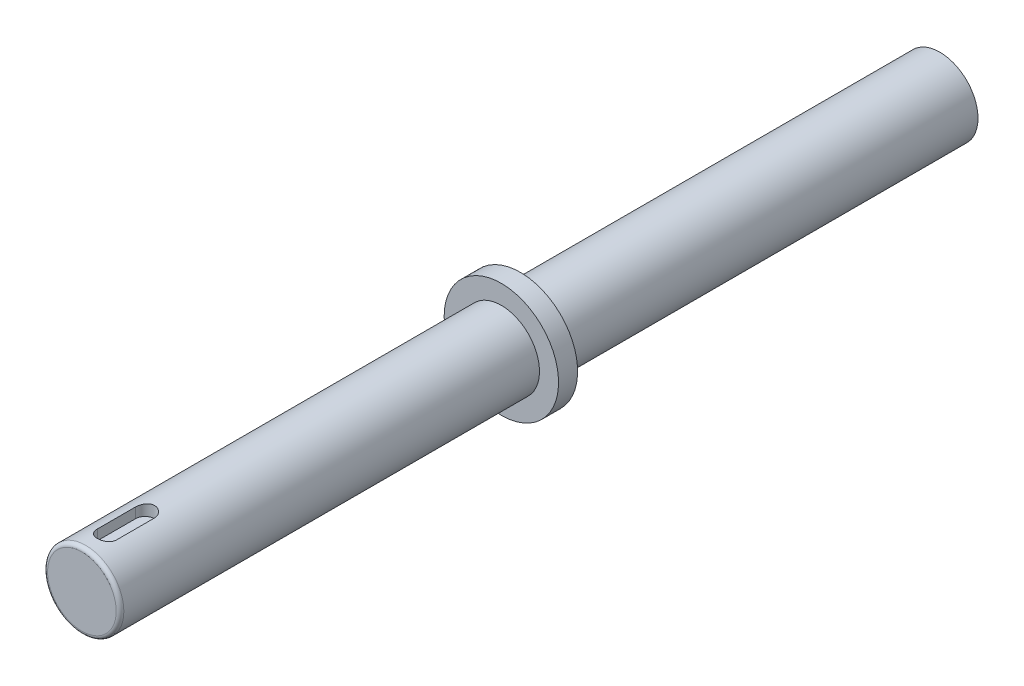
ISO-10303-21;
HEADER;
FILE_DESCRIPTION(('STEP AP214'),'2;1');
FILE_NAME('part.step','',(''),(''),'','','');
FILE_SCHEMA(('AUTOMOTIVE_DESIGN { 1 0 10303 214 1 1 1 1 }'));
ENDSEC;
DATA;
#1=APPLICATION_CONTEXT('core data for automotive mechanical design processes');
#2=APPLICATION_PROTOCOL_DEFINITION('international standard','automotive_design',2000,#1);
#3=PRODUCT_CONTEXT('',#1,'mechanical');
#4=PRODUCT('Part','Part','',(#3));
#5=PRODUCT_RELATED_PRODUCT_CATEGORY('part','',(#4));
#6=PRODUCT_DEFINITION_FORMATION('','',#4);
#7=PRODUCT_DEFINITION_CONTEXT('part definition',#1,'design');
#8=PRODUCT_DEFINITION('design','',#6,#7);
#9=PRODUCT_DEFINITION_SHAPE('','',#8);
#10=(LENGTH_UNIT() NAMED_UNIT(*) SI_UNIT(.MILLI.,.METRE.));
#11=(NAMED_UNIT(*) PLANE_ANGLE_UNIT() SI_UNIT($,.RADIAN.));
#12=(NAMED_UNIT(*) SI_UNIT($,.STERADIAN.) SOLID_ANGLE_UNIT());
#13=UNCERTAINTY_MEASURE_WITH_UNIT(LENGTH_MEASURE(1.E-05),#10,'distance_accuracy_value','');
#14=(GEOMETRIC_REPRESENTATION_CONTEXT(3) GLOBAL_UNCERTAINTY_ASSIGNED_CONTEXT((#13)) GLOBAL_UNIT_ASSIGNED_CONTEXT((#10,
#11,#12)) REPRESENTATION_CONTEXT('',''));
#15=CARTESIAN_POINT('',(0.,0.,0.));
#16=DIRECTION('',(0.,0.,1.));
#17=DIRECTION('',(1.,0.,0.));
#18=AXIS2_PLACEMENT_3D('',#15,#16,#17);
#19=CARTESIAN_POINT('',(0.,0.,225.));
#20=DIRECTION('',(0.,0.,-1.));
#21=DIRECTION('',(-1.,0.,0.));
#22=AXIS2_PLACEMENT_3D('',#19,#20,#21);
#23=CYLINDRICAL_SURFACE('',#22,10.);
#24=CARTESIAN_POINT('',(0.,0.,224.));
#25=DIRECTION('',(0.,0.,1.));
#26=DIRECTION('',(1.,0.,0.));
#27=AXIS2_PLACEMENT_3D('',#24,#25,#26);
#28=CIRCLE('',#27,10.);
#29=CARTESIAN_POINT('',(10.,0.,224.));
#30=VERTEX_POINT('',#29);
#31=EDGE_CURVE('E11',#30,#30,#28,.F.);
#32=ORIENTED_EDGE('',*,*,#31,.T.);
#33=EDGE_LOOP('',(#32));
#34=FACE_BOUND('',#33,.T.);
#35=CARTESIAN_POINT('',(0.,0.,115.));
#36=DIRECTION('',(0.,0.,-1.));
#37=DIRECTION('',(-1.,0.,0.));
#38=AXIS2_PLACEMENT_3D('',#35,#36,#37);
#39=CIRCLE('',#38,10.);
#40=CARTESIAN_POINT('',(-10.,0.,115.));
#41=VERTEX_POINT('',#40);
#42=EDGE_CURVE('E109',#41,#41,#39,.T.);
#43=ORIENTED_EDGE('',*,*,#42,.F.);
#44=EDGE_LOOP('',(#43));
#45=FACE_BOUND('',#44,.T.);
#46=CARTESIAN_POINT('',(2.5,9.68245836551854,208.431386242727));
#47=CARTESIAN_POINT('',(2.5000080093561,9.68245064107173,208.362248457578));
#48=CARTESIAN_POINT('',(2.49713210094488,9.68319871214971,208.293115423162));
#49=CARTESIAN_POINT('',(2.4856746565857,9.68614915569249,208.155366318143));
#50=CARTESIAN_POINT('',(2.477094080727,9.68835128344072,208.086750162514));
#51=CARTESIAN_POINT('',(2.4543119967113,9.6941468560817,207.950653244628));
#52=CARTESIAN_POINT('',(2.44012162652341,9.69773754375151,207.883170507132));
#53=CARTESIAN_POINT('',(2.40625174004097,9.70619672728078,207.749697432417));
#54=CARTESIAN_POINT('',(2.3865721482595,9.71106524071264,207.683707115735));
#55=CARTESIAN_POINT('',(2.31951549528411,9.7273836995917,207.488676161632));
#56=CARTESIAN_POINT('',(2.26409745840537,9.74055281563065,207.362438792887));
#57=CARTESIAN_POINT('',(2.13353299875772,9.7699788620753,207.121080368106));
#58=CARTESIAN_POINT('',(2.05838128580475,9.78623662015741,207.005962304257));
#59=CARTESIAN_POINT('',(1.88871268115755,9.82040642202058,206.787534051818));
#60=CARTESIAN_POINT('',(1.79384357452294,9.83834473874501,206.684501041515));
#61=CARTESIAN_POINT('',(1.58818904866333,9.87362764688863,206.495629004297));
#62=CARTESIAN_POINT('',(1.47740109012643,9.89097214303631,206.409792725776));
#63=CARTESIAN_POINT('',(1.24114235858889,9.92340454696925,206.256609289538));
#64=CARTESIAN_POINT('',(1.11548838031036,9.93845761433587,206.189536650254));
#65=CARTESIAN_POINT('',(0.854256447638938,9.96430865897157,206.077574259778));
#66=CARTESIAN_POINT('',(0.71868045238697,9.97510747358589,206.032680142844));
#67=CARTESIAN_POINT('',(0.444360278975154,9.99104749942438,205.967238799125));
#68=CARTESIAN_POINT('',(0.305735807058597,9.99629882234408,205.946217071936));
#69=CARTESIAN_POINT('',(0.0268319371530321,10.0009359539588,205.927627803605));
#70=CARTESIAN_POINT('',(-0.113447250615645,10.0003224998861,205.930057314525));
#71=CARTESIAN_POINT('',(-0.388381231898406,9.99338093409452,205.957961154602));
#72=CARTESIAN_POINT('',(-0.523091754207081,9.98717996692084,205.982922784939));
#73=CARTESIAN_POINT('',(-0.786346777853399,9.96990826592558,206.054357939971));
#74=CARTESIAN_POINT('',(-0.914891006098323,9.95883731664276,206.100832416457));
#75=CARTESIAN_POINT('',(-1.16351821502263,9.93287494404107,206.214389444598));
#76=CARTESIAN_POINT('',(-1.28351407399523,9.91794984568669,206.281654728361));
#77=CARTESIAN_POINT('',(-1.51069157808541,9.88589863855019,206.434744067259));
#78=CARTESIAN_POINT('',(-1.61787128890854,9.8687721983349,206.520570918346));
#79=CARTESIAN_POINT('',(-1.81942347426832,9.83363915056657,206.711083522945));
#80=CARTESIAN_POINT('',(-1.9133727576345,9.81562126192392,206.81621533408));
#81=CARTESIAN_POINT('',(-2.08242393796641,9.78115420711838,207.040960910043));
#82=CARTESIAN_POINT('',(-2.15752067561301,9.76470547114267,207.160578625937));
#83=CARTESIAN_POINT('',(-2.28701177321454,9.73519533958994,207.411750237286));
#84=CARTESIAN_POINT('',(-2.34129254471755,9.72215264997332,207.543364904962));
#85=CARTESIAN_POINT('',(-2.42675587962519,9.70117647043109,207.814178563779));
#86=CARTESIAN_POINT('',(-2.45797297303244,9.693235344986,207.953365880624));
#87=CARTESIAN_POINT('',(-2.48476158787698,9.6863822666606,208.150029694619));
#88=CARTESIAN_POINT('',(-2.49047697741524,9.68491307675692,208.206185500743));
#89=CARTESIAN_POINT('',(-2.49809189424097,9.6829515607634,208.318680717475));
#90=CARTESIAN_POINT('',(-2.49999759523778,9.68245765421489,208.375019682592));
#91=CARTESIAN_POINT('',(-2.5,9.68245836551854,208.431386242727));
#92=B_SPLINE_CURVE_WITH_KNOTS('',3,(#46,#47,#48,#49,#50,#51,#52,#53,#54,#55,#56,#57,#58,#59,#60,
#61,#62,#63,#64,#65,#66,#67,#68,#69,#70,#71,#72,#73,#74,#75,#76,#77,#78,#79,#80,#81,#82,#83,#84,
#85,#86,#87,#88,#89,#90,#91),.UNSPECIFIED.,.F.,.F.,(4,2,2,2,2,2,2,2,2,2,2,2,2,2,2,2,2,2,2,2,2,2,
4),(0.,0.207341325849406,0.414647765211617,0.621544658575852,0.828444397294139,1.24183269482213,
1.65533192641021,2.07697423316326,2.49868387344133,2.92627416704922,3.35378025790395,
3.77263152747646,4.19143014600931,4.60093312657523,5.0104542264893,5.42368222585276,
5.83697251370156,6.2614052279569,6.68595396911753,7.11278749362004,7.53898067809299,
7.70826570767019,7.87727618290648),.UNSPECIFIED.);
#93=CARTESIAN_POINT('',(2.5,9.68245836551854,208.431386242727));
#94=VERTEX_POINT('',#93);
#95=CARTESIAN_POINT('',(-2.5,9.68245836551854,208.431386242727));
#96=VERTEX_POINT('',#95);
#97=EDGE_CURVE('E53',#94,#96,#92,.T.);
#98=ORIENTED_EDGE('',*,*,#97,.F.);
#99=DIRECTION('',(0.,0.,-1.));
#100=VECTOR('',#99,1.);
#101=CARTESIAN_POINT('',(2.5,9.68245836551854,225.));
#102=LINE('',#101,#100);
#103=CARTESIAN_POINT('',(2.5,9.68245836551854,218.431386242727));
#104=VERTEX_POINT('',#103);
#105=EDGE_CURVE('E114',#104,#94,#102,.T.);
#106=ORIENTED_EDGE('',*,*,#105,.F.);
#107=CARTESIAN_POINT('',(-2.5,9.68245836551854,218.431386242727));
#108=CARTESIAN_POINT('',(-2.5000080093561,9.68245064107173,218.500524027877));
#109=CARTESIAN_POINT('',(-2.49713210094488,9.68319871214971,218.569657062292));
#110=CARTESIAN_POINT('',(-2.4856746565857,9.68614915569249,218.707406167312));
#111=CARTESIAN_POINT('',(-2.477094080727,9.68835128344072,218.776022322941));
#112=CARTESIAN_POINT('',(-2.4543119967113,9.6941468560817,218.912119240827));
#113=CARTESIAN_POINT('',(-2.44012162652341,9.69773754375151,218.979601978323));
#114=CARTESIAN_POINT('',(-2.40625174004097,9.70619672728078,219.113075053038));
#115=CARTESIAN_POINT('',(-2.3865721482595,9.71106524071264,219.179065369719));
#116=CARTESIAN_POINT('',(-2.31951549528412,9.7273836995917,219.374096323823));
#117=CARTESIAN_POINT('',(-2.26409745840539,9.74055281563065,219.500333692568));
#118=CARTESIAN_POINT('',(-2.13353299875774,9.76997886207529,219.741692117349));
#119=CARTESIAN_POINT('',(-2.05838128580476,9.7862366201574,219.856810181197));
#120=CARTESIAN_POINT('',(-1.88871268115755,9.82040642202058,220.075238433637));
#121=CARTESIAN_POINT('',(-1.79384357452293,9.83834473874501,220.178271443939));
#122=CARTESIAN_POINT('',(-1.58818904866332,9.87362764688863,220.367143481158));
#123=CARTESIAN_POINT('',(-1.47740109012642,9.89097214303631,220.452979759679));
#124=CARTESIAN_POINT('',(-1.24114235858888,9.92340454696925,220.606163195917));
#125=CARTESIAN_POINT('',(-1.11548838031036,9.93845761433587,220.6732358352));
#126=CARTESIAN_POINT('',(-0.854256447638939,9.96430865897157,220.785198225677));
#127=CARTESIAN_POINT('',(-0.71868045238697,9.97510747358589,220.830092342611));
#128=CARTESIAN_POINT('',(-0.444360278975154,9.99104749942438,220.89553368633));
#129=CARTESIAN_POINT('',(-0.305735807058597,9.99629882234408,220.916555413519));
#130=CARTESIAN_POINT('',(-0.0268319371530321,10.0009359539588,220.93514468185));
#131=CARTESIAN_POINT('',(0.113447250615645,10.0003224998861,220.93271517093));
#132=CARTESIAN_POINT('',(0.388381231898406,9.99338093409452,220.904811330853));
#133=CARTESIAN_POINT('',(0.523091754207081,9.98717996692084,220.879849700515));
#134=CARTESIAN_POINT('',(0.786346777853399,9.96990826592558,220.808414545484));
#135=CARTESIAN_POINT('',(0.914891006098323,9.95883731664276,220.761940068998));
#136=CARTESIAN_POINT('',(1.16351821502263,9.93287494404107,220.648383040857));
#137=CARTESIAN_POINT('',(1.28351407399523,9.91794984568669,220.581117757093));
#138=CARTESIAN_POINT('',(1.51069157808541,9.88589863855019,220.428028418196));
#139=CARTESIAN_POINT('',(1.61787128890854,9.86877219833489,220.342201567108));
#140=CARTESIAN_POINT('',(1.81942347426831,9.83363915056657,220.15168896251));
#141=CARTESIAN_POINT('',(1.91337275763449,9.81562126192392,220.046557151374));
#142=CARTESIAN_POINT('',(2.0824239379664,9.78115420711838,219.821811575412));
#143=CARTESIAN_POINT('',(2.15752067561301,9.76470547114267,219.702193859518));
#144=CARTESIAN_POINT('',(2.28701177321454,9.73519533958994,219.451022248169));
#145=CARTESIAN_POINT('',(2.34129254471755,9.72215264997332,219.319407580493));
#146=CARTESIAN_POINT('',(2.42675587962519,9.70117647043109,219.048593921676));
#147=CARTESIAN_POINT('',(2.45797297303244,9.693235344986,218.90940660483));
#148=CARTESIAN_POINT('',(2.48476158787698,9.6863822666606,218.712742790836));
#149=CARTESIAN_POINT('',(2.49047697741524,9.68491307675692,218.656586984711));
#150=CARTESIAN_POINT('',(2.49809189424097,9.6829515607634,218.54409176798));
#151=CARTESIAN_POINT('',(2.49999759523778,9.68245765421489,218.487752802862));
#152=CARTESIAN_POINT('',(2.5,9.68245836551854,218.431386242727));
#153=B_SPLINE_CURVE_WITH_KNOTS('',3,(#107,#108,#109,#110,#111,#112,#113,#114,#115,#116,#117,
#118,#119,#120,#121,#122,#123,#124,#125,#126,#127,#128,#129,#130,#131,#132,#133,#134,#135,#136,
#137,#138,#139,#140,#141,#142,#143,#144,#145,#146,#147,#148,#149,#150,#151,#152),.UNSPECIFIED.,
.F.,.F.,(4,2,2,2,2,2,2,2,2,2,2,2,2,2,2,2,2,2,2,2,2,2,4),(0.,0.207341325849406,0.414647765211617,
0.621544658575852,0.828444397294139,1.24183269482207,1.65533192641021,2.07697423316329,
2.49868387344133,2.92627416704922,3.35378025790396,3.77263152747646,4.19143014600931,
4.60093312657524,5.0104542264893,5.42368222585276,5.83697251370156,6.2614052279569,
6.68595396911753,7.11278749362004,7.53898067809299,7.70826570767019,7.87727618290648),.UNSPECIFIED.);
#154=CARTESIAN_POINT('',(-2.5,9.68245836551854,218.431386242727));
#155=VERTEX_POINT('',#154);
#156=EDGE_CURVE('E116',#155,#104,#153,.T.);
#157=ORIENTED_EDGE('',*,*,#156,.F.);
#158=DIRECTION('',(0.,0.,-1.));
#159=VECTOR('',#158,1.);
#160=CARTESIAN_POINT('',(-2.5,9.68245836551854,225.));
#161=LINE('',#160,#159);
#162=EDGE_CURVE('E122',#96,#155,#161,.F.);
#163=ORIENTED_EDGE('',*,*,#162,.F.);
#164=EDGE_LOOP('',(#98,#106,#157,#163));
#165=FACE_BOUND('',#164,.T.);
#166=ADVANCED_FACE('F30',(#34,#45,#165),#23,.T.);
#167=CARTESIAN_POINT('',(0.,0.,225.));
#168=DIRECTION('',(0.,0.,1.));
#169=DIRECTION('',(1.,0.,0.));
#170=AXIS2_PLACEMENT_3D('',#167,#168,#169);
#171=PLANE('',#170);
#172=CARTESIAN_POINT('',(0.,0.,225.));
#173=DIRECTION('',(0.,0.,1.));
#174=DIRECTION('',(1.,0.,0.));
#175=AXIS2_PLACEMENT_3D('',#172,#173,#174);
#176=CIRCLE('',#175,9.);
#177=CARTESIAN_POINT('',(9.,0.,225.));
#178=VERTEX_POINT('',#177);
#179=EDGE_CURVE('E38',#178,#178,#176,.T.);
#180=ORIENTED_EDGE('',*,*,#179,.T.);
#181=EDGE_LOOP('',(#180));
#182=FACE_BOUND('',#181,.T.);
#183=ADVANCED_FACE('F148',(#182),#171,.T.);
#184=CARTESIAN_POINT('',(0.,0.,115.));
#185=DIRECTION('',(0.,0.,-1.));
#186=DIRECTION('',(-1.,0.,0.));
#187=AXIS2_PLACEMENT_3D('',#184,#185,#186);
#188=PLANE('',#187);
#189=CARTESIAN_POINT('',(0.,0.,115.));
#190=DIRECTION('',(0.,0.,-1.));
#191=DIRECTION('',(-1.,0.,0.));
#192=AXIS2_PLACEMENT_3D('',#189,#190,#191);
#193=CIRCLE('',#192,15.);
#194=CARTESIAN_POINT('',(-15.,0.,115.));
#195=VERTEX_POINT('',#194);
#196=EDGE_CURVE('E100',#195,#195,#193,.T.);
#197=ORIENTED_EDGE('',*,*,#196,.F.);
#198=EDGE_LOOP('',(#197));
#199=FACE_BOUND('',#198,.T.);
#200=ORIENTED_EDGE('',*,*,#42,.T.);
#201=EDGE_LOOP('',(#200));
#202=FACE_BOUND('',#201,.T.);
#203=ADVANCED_FACE('F140',(#199,#202),#188,.F.);
#204=CARTESIAN_POINT('',(0.,0.,110.));
#205=DIRECTION('',(0.,0.,-1.));
#206=DIRECTION('',(-1.,0.,0.));
#207=AXIS2_PLACEMENT_3D('',#204,#205,#206);
#208=PLANE('',#207);
#209=CARTESIAN_POINT('',(0.,0.,110.));
#210=DIRECTION('',(0.,0.,-1.));
#211=DIRECTION('',(-1.,0.,0.));
#212=AXIS2_PLACEMENT_3D('',#209,#210,#211);
#213=CIRCLE('',#212,15.);
#214=CARTESIAN_POINT('',(-15.,0.,110.));
#215=VERTEX_POINT('',#214);
#216=EDGE_CURVE('E77',#215,#215,#213,.T.);
#217=ORIENTED_EDGE('',*,*,#216,.T.);
#218=EDGE_LOOP('',(#217));
#219=FACE_BOUND('',#218,.T.);
#220=CARTESIAN_POINT('',(0.,0.,110.));
#221=DIRECTION('',(0.,0.,-1.));
#222=DIRECTION('',(-1.,0.,0.));
#223=AXIS2_PLACEMENT_3D('',#220,#221,#222);
#224=CIRCLE('',#223,10.);
#225=CARTESIAN_POINT('',(-10.,0.,110.));
#226=VERTEX_POINT('',#225);
#227=EDGE_CURVE('E103',#226,#226,#224,.T.);
#228=ORIENTED_EDGE('',*,*,#227,.F.);
#229=EDGE_LOOP('',(#228));
#230=FACE_BOUND('',#229,.T.);
#231=ADVANCED_FACE('F175',(#219,#230),#208,.T.);
#232=CARTESIAN_POINT('',(0.,0.,115.));
#233=DIRECTION('',(0.,0.,-1.));
#234=DIRECTION('',(-1.,0.,0.));
#235=AXIS2_PLACEMENT_3D('',#232,#233,#234);
#236=CYLINDRICAL_SURFACE('',#235,15.);
#237=ORIENTED_EDGE('',*,*,#196,.T.);
#238=EDGE_LOOP('',(#237));
#239=FACE_BOUND('',#238,.T.);
#240=ORIENTED_EDGE('',*,*,#216,.F.);
#241=EDGE_LOOP('',(#240));
#242=FACE_BOUND('',#241,.T.);
#243=ADVANCED_FACE('F169',(#239,#242),#236,.T.);
#244=CARTESIAN_POINT('',(0.,0.,0.));
#245=DIRECTION('',(0.,0.,1.));
#246=DIRECTION('',(1.,0.,0.));
#247=AXIS2_PLACEMENT_3D('',#244,#245,#246);
#248=PLANE('',#247);
#249=CARTESIAN_POINT('',(0.,0.,0.));
#250=DIRECTION('',(0.,0.,1.));
#251=DIRECTION('',(1.,0.,0.));
#252=AXIS2_PLACEMENT_3D('',#249,#250,#251);
#253=CIRCLE('',#252,10.);
#254=CARTESIAN_POINT('',(10.,0.,0.));
#255=VERTEX_POINT('',#254);
#256=EDGE_CURVE('E106',#255,#255,#253,.T.);
#257=ORIENTED_EDGE('',*,*,#256,.F.);
#258=EDGE_LOOP('',(#257));
#259=FACE_BOUND('',#258,.T.);
#260=ADVANCED_FACE('F164',(#259),#248,.F.);
#261=ORIENTED_EDGE('',*,*,#227,.T.);
#262=EDGE_LOOP('',(#261));
#263=FACE_BOUND('',#262,.T.);
#264=ORIENTED_EDGE('',*,*,#256,.T.);
#265=EDGE_LOOP('',(#264));
#266=FACE_BOUND('',#265,.T.);
#267=ADVANCED_FACE('F124',(#263,#266),#23,.T.);
#268=CARTESIAN_POINT('',(0.,25.,208.431386242727));
#269=DIRECTION('',(0.,-1.,0.));
#270=DIRECTION('',(0.,0.,-1.));
#271=AXIS2_PLACEMENT_3D('',#268,#269,#270);
#272=CYLINDRICAL_SURFACE('',#271,2.5);
#273=ORIENTED_EDGE('',*,*,#97,.T.);
#274=DIRECTION('',(0.,-1.,0.));
#275=VECTOR('',#274,1.);
#276=CARTESIAN_POINT('',(-2.5,25.,208.431386242727));
#277=LINE('',#276,#275);
#278=CARTESIAN_POINT('',(-2.5,7.,208.431386242727));
#279=VERTEX_POINT('',#278);
#280=EDGE_CURVE('E70',#96,#279,#277,.T.);
#281=ORIENTED_EDGE('',*,*,#280,.T.);
#282=CARTESIAN_POINT('',(0.,7.,208.431386242727));
#283=DIRECTION('',(0.,1.,0.));
#284=DIRECTION('',(0.,0.,1.));
#285=AXIS2_PLACEMENT_3D('',#282,#283,#284);
#286=CIRCLE('',#285,2.5);
#287=CARTESIAN_POINT('',(2.5,7.,208.431386242727));
#288=VERTEX_POINT('',#287);
#289=EDGE_CURVE('E74',#288,#279,#286,.T.);
#290=ORIENTED_EDGE('',*,*,#289,.F.);
#291=DIRECTION('',(0.,-1.,0.));
#292=VECTOR('',#291,1.);
#293=CARTESIAN_POINT('',(2.5,25.,208.431386242727));
#294=LINE('',#293,#292);
#295=EDGE_CURVE('E96',#94,#288,#294,.T.);
#296=ORIENTED_EDGE('',*,*,#295,.F.);
#297=EDGE_LOOP('',(#273,#281,#290,#296));
#298=FACE_BOUND('',#297,.T.);
#299=ADVANCED_FACE('F72',(#298),#272,.F.);
#300=CARTESIAN_POINT('',(-2.5,25.,208.431386242727));
#301=DIRECTION('',(1.,0.,0.));
#302=DIRECTION('',(0.,0.,-1.));
#303=AXIS2_PLACEMENT_3D('',#300,#301,#302);
#304=PLANE('',#303);
#305=ORIENTED_EDGE('',*,*,#162,.T.);
#306=DIRECTION('',(0.,-1.,0.));
#307=VECTOR('',#306,1.);
#308=CARTESIAN_POINT('',(-2.5,25.,218.431386242727));
#309=LINE('',#308,#307);
#310=CARTESIAN_POINT('',(-2.5,7.,218.431386242727));
#311=VERTEX_POINT('',#310);
#312=EDGE_CURVE('E78',#155,#311,#309,.T.);
#313=ORIENTED_EDGE('',*,*,#312,.T.);
#314=DIRECTION('',(0.,0.,1.));
#315=VECTOR('',#314,1.);
#316=CARTESIAN_POINT('',(-2.5,7.,208.431386242727));
#317=LINE('',#316,#315);
#318=EDGE_CURVE('E81',#279,#311,#317,.T.);
#319=ORIENTED_EDGE('',*,*,#318,.F.);
#320=ORIENTED_EDGE('',*,*,#280,.F.);
#321=EDGE_LOOP('',(#305,#313,#319,#320));
#322=FACE_BOUND('',#321,.T.);
#323=ADVANCED_FACE('F82',(#322),#304,.T.);
#324=CARTESIAN_POINT('',(0.,25.,218.431386242727));
#325=DIRECTION('',(0.,-1.,0.));
#326=DIRECTION('',(0.,0.,-1.));
#327=AXIS2_PLACEMENT_3D('',#324,#325,#326);
#328=CYLINDRICAL_SURFACE('',#327,2.5);
#329=ORIENTED_EDGE('',*,*,#156,.T.);
#330=DIRECTION('',(0.,-1.,0.));
#331=VECTOR('',#330,1.);
#332=CARTESIAN_POINT('',(2.5,25.,218.431386242727));
#333=LINE('',#332,#331);
#334=CARTESIAN_POINT('',(2.5,7.,218.431386242727));
#335=VERTEX_POINT('',#334);
#336=EDGE_CURVE('E45',#104,#335,#333,.T.);
#337=ORIENTED_EDGE('',*,*,#336,.T.);
#338=CARTESIAN_POINT('',(0.,7.,218.431386242727));
#339=DIRECTION('',(0.,1.,0.));
#340=DIRECTION('',(0.,0.,1.));
#341=AXIS2_PLACEMENT_3D('',#338,#339,#340);
#342=CIRCLE('',#341,2.5);
#343=EDGE_CURVE('E87',#311,#335,#342,.T.);
#344=ORIENTED_EDGE('',*,*,#343,.F.);
#345=ORIENTED_EDGE('',*,*,#312,.F.);
#346=EDGE_LOOP('',(#329,#337,#344,#345));
#347=FACE_BOUND('',#346,.T.);
#348=ADVANCED_FACE('F127',(#347),#328,.F.);
#349=CARTESIAN_POINT('',(2.5,25.,208.431386242727));
#350=DIRECTION('',(-1.,0.,0.));
#351=DIRECTION('',(0.,0.,1.));
#352=AXIS2_PLACEMENT_3D('',#349,#350,#351);
#353=PLANE('',#352);
#354=ORIENTED_EDGE('',*,*,#105,.T.);
#355=ORIENTED_EDGE('',*,*,#295,.T.);
#356=DIRECTION('',(0.,0.,-1.));
#357=VECTOR('',#356,1.);
#358=CARTESIAN_POINT('',(2.5,7.,208.431386242727));
#359=LINE('',#358,#357);
#360=EDGE_CURVE('E91',#335,#288,#359,.T.);
#361=ORIENTED_EDGE('',*,*,#360,.F.);
#362=ORIENTED_EDGE('',*,*,#336,.F.);
#363=EDGE_LOOP('',(#354,#355,#361,#362));
#364=FACE_BOUND('',#363,.T.);
#365=ADVANCED_FACE('F132',(#364),#353,.T.);
#366=CARTESIAN_POINT('',(0.,7.,208.431386242727));
#367=DIRECTION('',(0.,1.,0.));
#368=DIRECTION('',(0.,0.,1.));
#369=AXIS2_PLACEMENT_3D('',#366,#367,#368);
#370=PLANE('',#369);
#371=ORIENTED_EDGE('',*,*,#289,.T.);
#372=ORIENTED_EDGE('',*,*,#318,.T.);
#373=ORIENTED_EDGE('',*,*,#343,.T.);
#374=ORIENTED_EDGE('',*,*,#360,.T.);
#375=EDGE_LOOP('',(#371,#372,#373,#374));
#376=FACE_BOUND('',#375,.T.);
#377=ADVANCED_FACE('F90',(#376),#370,.T.);
#378=CARTESIAN_POINT('',(0.,0.,224.));
#379=DIRECTION('',(0.,0.,1.));
#380=DIRECTION('',(1.,0.,0.));
#381=AXIS2_PLACEMENT_3D('',#378,#379,#380);
#382=TOROIDAL_SURFACE('',#381,9.,1.);
#383=ORIENTED_EDGE('',*,*,#31,.F.);
#384=EDGE_LOOP('',(#383));
#385=FACE_BOUND('',#384,.T.);
#386=ORIENTED_EDGE('',*,*,#179,.F.);
#387=EDGE_LOOP('',(#386));
#388=FACE_BOUND('',#387,.T.);
#389=ADVANCED_FACE('F32',(#385,#388),#382,.T.);
#390=CLOSED_SHELL('',(#166,#183,#203,#231,#243,#260,#267,#299,#323,#348,#365,#377,#389));
#391=MANIFOLD_SOLID_BREP('B2',#390);
#392=ADVANCED_BREP_SHAPE_REPRESENTATION('',(#18,#391),#14);
#393=SHAPE_DEFINITION_REPRESENTATION(#9,#392);
ENDSEC;
END-ISO-10303-21;
